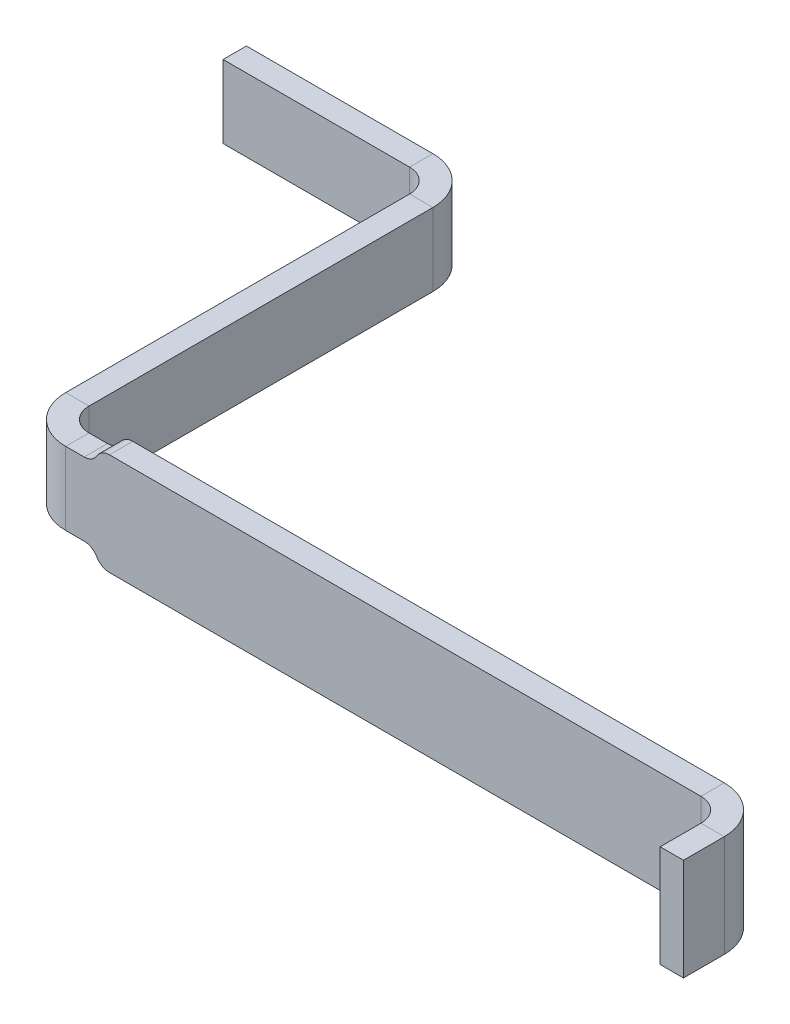
ISO-10303-21;
HEADER;
FILE_DESCRIPTION(('STEP AP214'),'2;1');
FILE_NAME('part.step','',(''),(''),'','','');
FILE_SCHEMA(('AUTOMOTIVE_DESIGN { 1 0 10303 214 1 1 1 1 }'));
ENDSEC;
DATA;
#1=APPLICATION_CONTEXT('core data for automotive mechanical design processes');
#2=APPLICATION_PROTOCOL_DEFINITION('international standard','automotive_design',2000,#1);
#3=PRODUCT_CONTEXT('',#1,'mechanical');
#4=PRODUCT('Part','Part','',(#3));
#5=PRODUCT_RELATED_PRODUCT_CATEGORY('part','',(#4));
#6=PRODUCT_DEFINITION_FORMATION('','',#4);
#7=PRODUCT_DEFINITION_CONTEXT('part definition',#1,'design');
#8=PRODUCT_DEFINITION('design','',#6,#7);
#9=PRODUCT_DEFINITION_SHAPE('','',#8);
#10=(LENGTH_UNIT() NAMED_UNIT(*) SI_UNIT(.MILLI.,.METRE.));
#11=(NAMED_UNIT(*) PLANE_ANGLE_UNIT() SI_UNIT($,.RADIAN.));
#12=(NAMED_UNIT(*) SI_UNIT($,.STERADIAN.) SOLID_ANGLE_UNIT());
#13=UNCERTAINTY_MEASURE_WITH_UNIT(LENGTH_MEASURE(1.E-05),#10,'distance_accuracy_value','');
#14=(GEOMETRIC_REPRESENTATION_CONTEXT(3) GLOBAL_UNCERTAINTY_ASSIGNED_CONTEXT((#13)) GLOBAL_UNIT_ASSIGNED_CONTEXT((#10,
#11,#12)) REPRESENTATION_CONTEXT('',''));
#15=CARTESIAN_POINT('',(0.,0.,0.));
#16=DIRECTION('',(0.,0.,1.));
#17=DIRECTION('',(1.,0.,0.));
#18=AXIS2_PLACEMENT_3D('',#15,#16,#17);
#19=CARTESIAN_POINT('',(0.05,0.,1.37));
#20=DIRECTION('',(0.,0.,-1.));
#21=DIRECTION('',(0.,-1.,0.));
#22=AXIS2_PLACEMENT_3D('',#19,#20,#21);
#23=PLANE('',#22);
#24=DIRECTION('',(-1.,0.,0.));
#25=VECTOR('',#24,1.);
#26=CARTESIAN_POINT('',(-0.463301270189222,0.125,1.37));
#27=LINE('',#26,#25);
#28=CARTESIAN_POINT('',(-0.976602540378444,0.125,1.37));
#29=VERTEX_POINT('',#28);
#30=CARTESIAN_POINT('',(-1.04,0.125,1.37));
#31=VERTEX_POINT('',#30);
#32=EDGE_CURVE('E300',#29,#31,#27,.T.);
#33=ORIENTED_EDGE('',*,*,#32,.T.);
#34=DIRECTION('',(0.,-1.,0.));
#35=VECTOR('',#34,1.);
#36=CARTESIAN_POINT('',(-1.04,-0.0875,1.37));
#37=LINE('',#36,#35);
#38=CARTESIAN_POINT('',(-1.04,-0.125,1.37));
#39=VERTEX_POINT('',#38);
#40=EDGE_CURVE('E417',#31,#39,#37,.T.);
#41=ORIENTED_EDGE('',*,*,#40,.T.);
#42=DIRECTION('',(1.,0.,0.));
#43=VECTOR('',#42,1.);
#44=CARTESIAN_POINT('',(-1.56836281798667,-0.125,1.37));
#45=LINE('',#44,#43);
#46=CARTESIAN_POINT('',(-0.976602540378444,-0.125,1.37));
#47=VERTEX_POINT('',#46);
#48=EDGE_CURVE('E274',#39,#47,#45,.T.);
#49=ORIENTED_EDGE('',*,*,#48,.T.);
#50=CARTESIAN_POINT('',(-0.976602540378444,-0.175,1.37));
#51=DIRECTION('',(0.,0.,-1.));
#52=DIRECTION('',(0.866025403784445,0.499999999999988,0.));
#53=AXIS2_PLACEMENT_3D('',#50,#51,#52);
#54=CIRCLE('',#53,0.05);
#55=CARTESIAN_POINT('',(-0.933301270189222,-0.15,1.37));
#56=VERTEX_POINT('',#55);
#57=EDGE_CURVE('E66',#47,#56,#54,.T.);
#58=ORIENTED_EDGE('',*,*,#57,.T.);
#59=CARTESIAN_POINT('',(-0.89,-0.125,1.37));
#60=DIRECTION('',(0.,0.,1.));
#61=DIRECTION('',(-0.86602540378444,-0.5,0.));
#62=AXIS2_PLACEMENT_3D('',#59,#60,#61);
#63=CIRCLE('',#62,0.05);
#64=CARTESIAN_POINT('',(-0.89,-0.175,1.37));
#65=VERTEX_POINT('',#64);
#66=EDGE_CURVE('E184',#56,#65,#63,.T.);
#67=ORIENTED_EDGE('',*,*,#66,.T.);
#68=DIRECTION('',(1.,0.,0.));
#69=VECTOR('',#68,1.);
#70=CARTESIAN_POINT('',(-1.2,-0.175,1.37));
#71=LINE('',#70,#69);
#72=CARTESIAN_POINT('',(1.14,-0.175,1.37));
#73=VERTEX_POINT('',#72);
#74=EDGE_CURVE('E11',#65,#73,#71,.T.);
#75=ORIENTED_EDGE('',*,*,#74,.T.);
#76=DIRECTION('',(0.,1.,0.));
#77=VECTOR('',#76,1.);
#78=CARTESIAN_POINT('',(1.14,-0.0875,1.37));
#79=LINE('',#78,#77);
#80=CARTESIAN_POINT('',(1.14,0.175,1.37));
#81=VERTEX_POINT('',#80);
#82=EDGE_CURVE('E28',#73,#81,#79,.T.);
#83=ORIENTED_EDGE('',*,*,#82,.T.);
#84=DIRECTION('',(-1.,0.,0.));
#85=VECTOR('',#84,1.);
#86=CARTESIAN_POINT('',(1.3,0.175,1.37));
#87=LINE('',#86,#85);
#88=CARTESIAN_POINT('',(-0.89,0.175,1.37));
#89=VERTEX_POINT('',#88);
#90=EDGE_CURVE('E233',#81,#89,#87,.T.);
#91=ORIENTED_EDGE('',*,*,#90,.T.);
#92=CARTESIAN_POINT('',(-0.89,0.125,1.37));
#93=DIRECTION('',(0.,0.,1.));
#94=DIRECTION('',(0.,1.,0.));
#95=AXIS2_PLACEMENT_3D('',#92,#93,#94);
#96=CIRCLE('',#95,0.05);
#97=CARTESIAN_POINT('',(-0.933301270189222,0.15,1.37));
#98=VERTEX_POINT('',#97);
#99=EDGE_CURVE('E281',#89,#98,#96,.T.);
#100=ORIENTED_EDGE('',*,*,#99,.T.);
#101=CARTESIAN_POINT('',(-0.976602540378444,0.175,1.37));
#102=DIRECTION('',(0.,0.,-1.));
#103=DIRECTION('',(0.,-1.,0.));
#104=AXIS2_PLACEMENT_3D('',#101,#102,#103);
#105=CIRCLE('',#104,0.05);
#106=EDGE_CURVE('E280',#98,#29,#105,.T.);
#107=ORIENTED_EDGE('',*,*,#106,.T.);
#108=EDGE_LOOP('',(#33,#41,#49,#58,#67,#75,#83,#91,#100,#107));
#109=FACE_BOUND('',#108,.T.);
#110=ADVANCED_FACE('F17',(#109),#23,.F.);
#111=CARTESIAN_POINT('',(1.3,-0.175,1.37));
#112=DIRECTION('',(0.,-1.,0.));
#113=DIRECTION('',(0.,0.,-1.));
#114=AXIS2_PLACEMENT_3D('',#111,#112,#113);
#115=PLANE('',#114);
#116=DIRECTION('',(0.,0.,1.));
#117=VECTOR('',#116,1.);
#118=CARTESIAN_POINT('',(-0.89,-0.175,1.37));
#119=LINE('',#118,#117);
#120=CARTESIAN_POINT('',(-0.89,-0.175,1.29));
#121=VERTEX_POINT('',#120);
#122=EDGE_CURVE('E194',#121,#65,#119,.T.);
#123=ORIENTED_EDGE('',*,*,#122,.F.);
#124=DIRECTION('',(-1.,0.,0.));
#125=VECTOR('',#124,1.);
#126=CARTESIAN_POINT('',(-1.2,-0.175,1.29));
#127=LINE('',#126,#125);
#128=CARTESIAN_POINT('',(1.14,-0.175,1.29));
#129=VERTEX_POINT('',#128);
#130=EDGE_CURVE('E191',#129,#121,#127,.T.);
#131=ORIENTED_EDGE('',*,*,#130,.F.);
#132=DIRECTION('',(0.,0.,1.));
#133=VECTOR('',#132,1.);
#134=CARTESIAN_POINT('',(1.14,-0.175,1.37));
#135=LINE('',#134,#133);
#136=EDGE_CURVE('E303',#129,#73,#135,.T.);
#137=ORIENTED_EDGE('',*,*,#136,.T.);
#138=ORIENTED_EDGE('',*,*,#74,.F.);
#139=EDGE_LOOP('',(#123,#131,#137,#138));
#140=FACE_BOUND('',#139,.T.);
#141=ADVANCED_FACE('F812',(#140),#115,.T.);
#142=CARTESIAN_POINT('',(1.3,0.,0.196637182013331));
#143=DIRECTION('',(1.,0.,0.));
#144=DIRECTION('',(0.,0.,1.));
#145=AXIS2_PLACEMENT_3D('',#142,#143,#144);
#146=PLANE('',#145);
#147=DIRECTION('',(0.,1.,0.));
#148=VECTOR('',#147,1.);
#149=CARTESIAN_POINT('',(1.3,0.,1.45));
#150=LINE('',#149,#148);
#151=CARTESIAN_POINT('',(1.3,-0.175,1.45));
#152=VERTEX_POINT('',#151);
#153=CARTESIAN_POINT('',(1.3,0.175,1.45));
#154=VERTEX_POINT('',#153);
#155=EDGE_CURVE('E332',#152,#154,#150,.T.);
#156=ORIENTED_EDGE('',*,*,#155,.T.);
#157=DIRECTION('',(0.,0.,1.));
#158=VECTOR('',#157,1.);
#159=CARTESIAN_POINT('',(1.3,0.175,1.12327436402666));
#160=LINE('',#159,#158);
#161=CARTESIAN_POINT('',(1.3,0.175,1.59));
#162=VERTEX_POINT('',#161);
#163=EDGE_CURVE('E289',#154,#162,#160,.T.);
#164=ORIENTED_EDGE('',*,*,#163,.T.);
#165=DIRECTION('',(0.,-1.,0.));
#166=VECTOR('',#165,1.);
#167=CARTESIAN_POINT('',(1.3,-0.175,1.59));
#168=LINE('',#167,#166);
#169=CARTESIAN_POINT('',(1.3,-0.175,1.59));
#170=VERTEX_POINT('',#169);
#171=EDGE_CURVE('E42',#162,#170,#168,.T.);
#172=ORIENTED_EDGE('',*,*,#171,.T.);
#173=DIRECTION('',(0.,0.,-1.));
#174=VECTOR('',#173,1.);
#175=CARTESIAN_POINT('',(1.3,-0.175,1.45));
#176=LINE('',#175,#174);
#177=EDGE_CURVE('E312',#170,#152,#176,.T.);
#178=ORIENTED_EDGE('',*,*,#177,.T.);
#179=EDGE_LOOP('',(#156,#164,#172,#178));
#180=FACE_BOUND('',#179,.T.);
#181=ADVANCED_FACE('F554',(#180),#146,.T.);
#182=CARTESIAN_POINT('',(1.14,0.,1.45));
#183=DIRECTION('',(0.,-1.,0.));
#184=DIRECTION('',(0.,0.,-1.));
#185=AXIS2_PLACEMENT_3D('',#182,#183,#184);
#186=CYLINDRICAL_SURFACE('',#185,0.08);
#187=DIRECTION('',(0.,-1.,0.));
#188=VECTOR('',#187,1.);
#189=CARTESIAN_POINT('',(1.22,0.,1.45));
#190=LINE('',#189,#188);
#191=CARTESIAN_POINT('',(1.22,0.175,1.45));
#192=VERTEX_POINT('',#191);
#193=CARTESIAN_POINT('',(1.22,-0.175,1.45));
#194=VERTEX_POINT('',#193);
#195=EDGE_CURVE('E231',#192,#194,#190,.T.);
#196=ORIENTED_EDGE('',*,*,#195,.F.);
#197=CARTESIAN_POINT('',(1.14,0.175,1.45));
#198=DIRECTION('',(0.,1.,0.));
#199=DIRECTION('',(1.,0.,0.));
#200=AXIS2_PLACEMENT_3D('',#197,#198,#199);
#201=CIRCLE('',#200,0.08);
#202=EDGE_CURVE('E307',#192,#81,#201,.T.);
#203=ORIENTED_EDGE('',*,*,#202,.T.);
#204=ORIENTED_EDGE('',*,*,#82,.F.);
#205=CARTESIAN_POINT('',(1.14,-0.175,1.45));
#206=DIRECTION('',(0.,1.,0.));
#207=DIRECTION('',(1.,0.,0.));
#208=AXIS2_PLACEMENT_3D('',#205,#206,#207);
#209=CIRCLE('',#208,0.08);
#210=EDGE_CURVE('E308',#194,#73,#209,.T.);
#211=ORIENTED_EDGE('',*,*,#210,.F.);
#212=EDGE_LOOP('',(#196,#203,#204,#211));
#213=FACE_BOUND('',#212,.T.);
#214=ADVANCED_FACE('F543',(#213),#186,.F.);
#215=CARTESIAN_POINT('',(1.22,0.175,1.59));
#216=DIRECTION('',(0.,0.,1.));
#217=DIRECTION('',(1.,0.,0.));
#218=AXIS2_PLACEMENT_3D('',#215,#216,#217);
#219=PLANE('',#218);
#220=DIRECTION('',(0.,1.,0.));
#221=VECTOR('',#220,1.);
#222=CARTESIAN_POINT('',(1.22,-0.175,1.59));
#223=LINE('',#222,#221);
#224=CARTESIAN_POINT('',(1.22,-0.175,1.59));
#225=VERTEX_POINT('',#224);
#226=CARTESIAN_POINT('',(1.22,0.175,1.59));
#227=VERTEX_POINT('',#226);
#228=EDGE_CURVE('E230',#225,#227,#223,.T.);
#229=ORIENTED_EDGE('',*,*,#228,.F.);
#230=DIRECTION('',(1.,0.,0.));
#231=VECTOR('',#230,1.);
#232=CARTESIAN_POINT('',(1.22,-0.175,1.59));
#233=LINE('',#232,#231);
#234=EDGE_CURVE('E21',#225,#170,#233,.T.);
#235=ORIENTED_EDGE('',*,*,#234,.T.);
#236=ORIENTED_EDGE('',*,*,#171,.F.);
#237=DIRECTION('',(1.,0.,0.));
#238=VECTOR('',#237,1.);
#239=CARTESIAN_POINT('',(1.22,0.175,1.59));
#240=LINE('',#239,#238);
#241=EDGE_CURVE('E285',#227,#162,#240,.T.);
#242=ORIENTED_EDGE('',*,*,#241,.F.);
#243=EDGE_LOOP('',(#229,#235,#236,#242));
#244=FACE_BOUND('',#243,.T.);
#245=ADVANCED_FACE('F840',(#244),#219,.T.);
#246=CARTESIAN_POINT('',(1.22,-0.175,1.59));
#247=DIRECTION('',(0.,-1.,0.));
#248=DIRECTION('',(0.,0.,-1.));
#249=AXIS2_PLACEMENT_3D('',#246,#247,#248);
#250=PLANE('',#249);
#251=DIRECTION('',(1.,0.,0.));
#252=VECTOR('',#251,1.);
#253=CARTESIAN_POINT('',(1.232,-0.175,1.45));
#254=LINE('',#253,#252);
#255=EDGE_CURVE('E351',#194,#152,#254,.T.);
#256=ORIENTED_EDGE('',*,*,#255,.T.);
#257=ORIENTED_EDGE('',*,*,#177,.F.);
#258=ORIENTED_EDGE('',*,*,#234,.F.);
#259=DIRECTION('',(0.,0.,-1.));
#260=VECTOR('',#259,1.);
#261=CARTESIAN_POINT('',(1.22,-0.175,1.12327436402666));
#262=LINE('',#261,#260);
#263=EDGE_CURVE('E227',#225,#194,#262,.T.);
#264=ORIENTED_EDGE('',*,*,#263,.T.);
#265=EDGE_LOOP('',(#256,#257,#258,#264));
#266=FACE_BOUND('',#265,.T.);
#267=ADVANCED_FACE('F897',(#266),#250,.T.);
#268=CARTESIAN_POINT('',(1.3,0.175,1.45));
#269=DIRECTION('',(0.,1.,0.));
#270=DIRECTION('',(1.,0.,0.));
#271=AXIS2_PLACEMENT_3D('',#268,#269,#270);
#272=PLANE('',#271);
#273=DIRECTION('',(-1.,0.,0.));
#274=VECTOR('',#273,1.);
#275=CARTESIAN_POINT('',(1.232,0.175,1.45));
#276=LINE('',#275,#274);
#277=EDGE_CURVE('E371',#154,#192,#276,.T.);
#278=ORIENTED_EDGE('',*,*,#277,.F.);
#279=CARTESIAN_POINT('',(1.14,0.175,1.45));
#280=DIRECTION('',(0.,-1.,0.));
#281=DIRECTION('',(0.,0.,-1.));
#282=AXIS2_PLACEMENT_3D('',#279,#280,#281);
#283=CIRCLE('',#282,0.16);
#284=CARTESIAN_POINT('',(1.14,0.175,1.29));
#285=VERTEX_POINT('',#284);
#286=EDGE_CURVE('E331',#285,#154,#283,.T.);
#287=ORIENTED_EDGE('',*,*,#286,.F.);
#288=DIRECTION('',(0.,0.,-1.));
#289=VECTOR('',#288,1.);
#290=CARTESIAN_POINT('',(1.14,0.175,1.37));
#291=LINE('',#290,#289);
#292=EDGE_CURVE('E216',#81,#285,#291,.T.);
#293=ORIENTED_EDGE('',*,*,#292,.F.);
#294=ORIENTED_EDGE('',*,*,#202,.F.);
#295=EDGE_LOOP('',(#278,#287,#293,#294));
#296=FACE_BOUND('',#295,.T.);
#297=ADVANCED_FACE('F539',(#296),#272,.T.);
#298=CARTESIAN_POINT('',(1.22,-0.175,1.45));
#299=DIRECTION('',(0.,-1.,0.));
#300=DIRECTION('',(0.,0.,-1.));
#301=AXIS2_PLACEMENT_3D('',#298,#299,#300);
#302=PLANE('',#301);
#303=ORIENTED_EDGE('',*,*,#255,.F.);
#304=ORIENTED_EDGE('',*,*,#210,.T.);
#305=ORIENTED_EDGE('',*,*,#136,.F.);
#306=CARTESIAN_POINT('',(1.14,-0.175,1.45));
#307=DIRECTION('',(0.,1.,0.));
#308=DIRECTION('',(1.,0.,0.));
#309=AXIS2_PLACEMENT_3D('',#306,#307,#308);
#310=CIRCLE('',#309,0.16);
#311=EDGE_CURVE('E327',#152,#129,#310,.T.);
#312=ORIENTED_EDGE('',*,*,#311,.F.);
#313=EDGE_LOOP('',(#303,#304,#305,#312));
#314=FACE_BOUND('',#313,.T.);
#315=ADVANCED_FACE('F925',(#314),#302,.T.);
#316=CARTESIAN_POINT('',(1.22,0.,0.196637182013331));
#317=DIRECTION('',(1.,0.,0.));
#318=DIRECTION('',(0.,0.,1.));
#319=AXIS2_PLACEMENT_3D('',#316,#317,#318);
#320=PLANE('',#319);
#321=ORIENTED_EDGE('',*,*,#195,.T.);
#322=ORIENTED_EDGE('',*,*,#263,.F.);
#323=ORIENTED_EDGE('',*,*,#228,.T.);
#324=DIRECTION('',(0.,0.,-1.));
#325=VECTOR('',#324,1.);
#326=CARTESIAN_POINT('',(1.22,0.175,1.12327436402666));
#327=LINE('',#326,#325);
#328=EDGE_CURVE('E290',#227,#192,#327,.T.);
#329=ORIENTED_EDGE('',*,*,#328,.T.);
#330=EDGE_LOOP('',(#321,#322,#323,#329));
#331=FACE_BOUND('',#330,.T.);
#332=ADVANCED_FACE('F548',(#331),#320,.F.);
#333=CARTESIAN_POINT('',(1.22,0.175,1.28663718201333));
#334=DIRECTION('',(0.,1.,0.));
#335=DIRECTION('',(1.,0.,0.));
#336=AXIS2_PLACEMENT_3D('',#333,#334,#335);
#337=PLANE('',#336);
#338=ORIENTED_EDGE('',*,*,#277,.T.);
#339=ORIENTED_EDGE('',*,*,#328,.F.);
#340=ORIENTED_EDGE('',*,*,#241,.T.);
#341=ORIENTED_EDGE('',*,*,#163,.F.);
#342=EDGE_LOOP('',(#338,#339,#340,#341));
#343=FACE_BOUND('',#342,.T.);
#344=ADVANCED_FACE('F552',(#343),#337,.T.);
#345=CARTESIAN_POINT('',(1.14,0.,1.45));
#346=DIRECTION('',(0.,-1.,0.));
#347=DIRECTION('',(0.,0.,-1.));
#348=AXIS2_PLACEMENT_3D('',#345,#346,#347);
#349=CYLINDRICAL_SURFACE('',#348,0.16);
#350=ORIENTED_EDGE('',*,*,#155,.F.);
#351=ORIENTED_EDGE('',*,*,#311,.T.);
#352=DIRECTION('',(0.,-1.,0.));
#353=VECTOR('',#352,1.);
#354=CARTESIAN_POINT('',(1.14,-0.0875,1.29));
#355=LINE('',#354,#353);
#356=EDGE_CURVE('E217',#285,#129,#355,.T.);
#357=ORIENTED_EDGE('',*,*,#356,.F.);
#358=ORIENTED_EDGE('',*,*,#286,.T.);
#359=EDGE_LOOP('',(#350,#351,#357,#358));
#360=FACE_BOUND('',#359,.T.);
#361=ADVANCED_FACE('F829',(#360),#349,.T.);
#362=CARTESIAN_POINT('',(-1.2,0.,2.46336281798667));
#363=DIRECTION('',(1.,0.,0.));
#364=DIRECTION('',(0.,0.,1.));
#365=AXIS2_PLACEMENT_3D('',#362,#363,#364);
#366=PLANE('',#365);
#367=DIRECTION('',(0.,0.,-1.));
#368=VECTOR('',#367,1.);
#369=CARTESIAN_POINT('',(-1.2,0.125,1.95006154779745));
#370=LINE('',#369,#368);
#371=CARTESIAN_POINT('',(-1.2,0.125,1.21));
#372=VERTEX_POINT('',#371);
#373=CARTESIAN_POINT('',(-1.2,0.125,0.0299999999999995));
#374=VERTEX_POINT('',#373);
#375=EDGE_CURVE('E273',#372,#374,#370,.T.);
#376=ORIENTED_EDGE('',*,*,#375,.T.);
#377=DIRECTION('',(0.,-1.,0.));
#378=VECTOR('',#377,1.);
#379=CARTESIAN_POINT('',(-1.2,0.0875,0.0299999999999995));
#380=LINE('',#379,#378);
#381=CARTESIAN_POINT('',(-1.2,-0.125,0.0299999999999995));
#382=VERTEX_POINT('',#381);
#383=EDGE_CURVE('E252',#374,#382,#380,.T.);
#384=ORIENTED_EDGE('',*,*,#383,.T.);
#385=DIRECTION('',(0.,0.,1.));
#386=VECTOR('',#385,1.);
#387=CARTESIAN_POINT('',(-1.2,-0.125,0.845));
#388=LINE('',#387,#386);
#389=CARTESIAN_POINT('',(-1.2,-0.125,1.21));
#390=VERTEX_POINT('',#389);
#391=EDGE_CURVE('E269',#382,#390,#388,.T.);
#392=ORIENTED_EDGE('',*,*,#391,.T.);
#393=DIRECTION('',(0.,1.,0.));
#394=VECTOR('',#393,1.);
#395=CARTESIAN_POINT('',(-1.2,0.,1.21));
#396=LINE('',#395,#394);
#397=EDGE_CURVE('E262',#390,#372,#396,.T.);
#398=ORIENTED_EDGE('',*,*,#397,.T.);
#399=EDGE_LOOP('',(#376,#384,#392,#398));
#400=FACE_BOUND('',#399,.T.);
#401=ADVANCED_FACE('F823',(#400),#366,.F.);
#402=CARTESIAN_POINT('',(-1.04,0.,1.21));
#403=DIRECTION('',(0.,-1.,0.));
#404=DIRECTION('',(0.,0.,1.));
#405=AXIS2_PLACEMENT_3D('',#402,#403,#404);
#406=CYLINDRICAL_SURFACE('',#405,0.16);
#407=CARTESIAN_POINT('',(-1.04,0.125,1.21));
#408=DIRECTION('',(0.,-1.,0.));
#409=DIRECTION('',(0.,0.,1.));
#410=AXIS2_PLACEMENT_3D('',#407,#408,#409);
#411=CIRCLE('',#410,0.16);
#412=EDGE_CURVE('E408',#31,#372,#411,.T.);
#413=ORIENTED_EDGE('',*,*,#412,.T.);
#414=ORIENTED_EDGE('',*,*,#397,.F.);
#415=CARTESIAN_POINT('',(-1.04,-0.125,1.21));
#416=DIRECTION('',(0.,1.,0.));
#417=DIRECTION('',(-1.,0.,0.));
#418=AXIS2_PLACEMENT_3D('',#415,#416,#417);
#419=CIRCLE('',#418,0.16);
#420=EDGE_CURVE('E225',#390,#39,#419,.T.);
#421=ORIENTED_EDGE('',*,*,#420,.T.);
#422=ORIENTED_EDGE('',*,*,#40,.F.);
#423=EDGE_LOOP('',(#413,#414,#421,#422));
#424=FACE_BOUND('',#423,.T.);
#425=ADVANCED_FACE('F828',(#424),#406,.T.);
#426=CARTESIAN_POINT('',(1.31672563597334,0.,-0.129999999999998));
#427=DIRECTION('',(0.,0.,-1.));
#428=DIRECTION('',(0.,-1.,0.));
#429=AXIS2_PLACEMENT_3D('',#426,#427,#428);
#430=PLANE('',#429);
#431=DIRECTION('',(1.,0.,0.));
#432=VECTOR('',#431,1.);
#433=CARTESIAN_POINT('',(0.803424365784118,0.125,-0.13));
#434=LINE('',#433,#432);
#435=CARTESIAN_POINT('',(-1.92,0.125,-0.13));
#436=VERTEX_POINT('',#435);
#437=CARTESIAN_POINT('',(-1.28,0.125,-0.13));
#438=VERTEX_POINT('',#437);
#439=EDGE_CURVE('E378',#436,#438,#434,.T.);
#440=ORIENTED_EDGE('',*,*,#439,.T.);
#441=DIRECTION('',(0.,-1.,0.));
#442=VECTOR('',#441,1.);
#443=CARTESIAN_POINT('',(-1.28,0.,-0.13));
#444=LINE('',#443,#442);
#445=CARTESIAN_POINT('',(-1.28,-0.125,-0.13));
#446=VERTEX_POINT('',#445);
#447=EDGE_CURVE('E263',#438,#446,#444,.T.);
#448=ORIENTED_EDGE('',*,*,#447,.T.);
#449=DIRECTION('',(-1.,0.,0.));
#450=VECTOR('',#449,1.);
#451=CARTESIAN_POINT('',(-0.30163718201333,-0.125,-0.13));
#452=LINE('',#451,#450);
#453=CARTESIAN_POINT('',(-1.92,-0.125,-0.13));
#454=VERTEX_POINT('',#453);
#455=EDGE_CURVE('E195',#446,#454,#452,.T.);
#456=ORIENTED_EDGE('',*,*,#455,.T.);
#457=DIRECTION('',(0.,1.,0.));
#458=VECTOR('',#457,1.);
#459=CARTESIAN_POINT('',(-1.92,0.175,-0.13));
#460=LINE('',#459,#458);
#461=EDGE_CURVE('E258',#454,#436,#460,.T.);
#462=ORIENTED_EDGE('',*,*,#461,.T.);
#463=EDGE_LOOP('',(#440,#448,#456,#462));
#464=FACE_BOUND('',#463,.T.);
#465=ADVANCED_FACE('F798',(#464),#430,.T.);
#466=CARTESIAN_POINT('',(-1.92,-0.175,-0.0500000000000009));
#467=DIRECTION('',(-1.,0.,0.));
#468=DIRECTION('',(0.,0.,1.));
#469=AXIS2_PLACEMENT_3D('',#466,#467,#468);
#470=PLANE('',#469);
#471=DIRECTION('',(0.,0.,-1.));
#472=VECTOR('',#471,1.);
#473=CARTESIAN_POINT('',(-1.92,0.125,-0.0500000000000009));
#474=LINE('',#473,#472);
#475=CARTESIAN_POINT('',(-1.92,0.125,-0.0500000000000053));
#476=VERTEX_POINT('',#475);
#477=EDGE_CURVE('E382',#476,#436,#474,.T.);
#478=ORIENTED_EDGE('',*,*,#477,.T.);
#479=ORIENTED_EDGE('',*,*,#461,.F.);
#480=DIRECTION('',(0.,0.,1.));
#481=VECTOR('',#480,1.);
#482=CARTESIAN_POINT('',(-1.92,-0.125,-0.0500000000000031));
#483=LINE('',#482,#481);
#484=CARTESIAN_POINT('',(-1.92,-0.125,-0.0500000000000053));
#485=VERTEX_POINT('',#484);
#486=EDGE_CURVE('E204',#454,#485,#483,.T.);
#487=ORIENTED_EDGE('',*,*,#486,.T.);
#488=DIRECTION('',(0.,-1.,0.));
#489=VECTOR('',#488,1.);
#490=CARTESIAN_POINT('',(-1.92,0.175,-0.0500000000000009));
#491=LINE('',#490,#489);
#492=EDGE_CURVE('E220',#476,#485,#491,.T.);
#493=ORIENTED_EDGE('',*,*,#492,.F.);
#494=EDGE_LOOP('',(#478,#479,#487,#493));
#495=FACE_BOUND('',#494,.T.);
#496=ADVANCED_FACE('F792',(#495),#470,.T.);
#497=CARTESIAN_POINT('',(-1.28,0.,0.0299999999999992));
#498=DIRECTION('',(0.,1.,0.));
#499=DIRECTION('',(1.,0.,0.));
#500=AXIS2_PLACEMENT_3D('',#497,#498,#499);
#501=CYLINDRICAL_SURFACE('',#500,0.159999999999997);
#502=CARTESIAN_POINT('',(-1.28,0.125,0.0299999999999992));
#503=DIRECTION('',(0.,-1.,0.));
#504=DIRECTION('',(0.,0.,-1.));
#505=AXIS2_PLACEMENT_3D('',#502,#503,#504);
#506=CIRCLE('',#505,0.160000000000003);
#507=CARTESIAN_POINT('',(-1.12,0.125,0.0299999999999995));
#508=VERTEX_POINT('',#507);
#509=EDGE_CURVE('E363',#438,#508,#506,.T.);
#510=ORIENTED_EDGE('',*,*,#509,.T.);
#511=DIRECTION('',(0.,1.,0.));
#512=VECTOR('',#511,1.);
#513=CARTESIAN_POINT('',(-1.12,0.0875,0.0299999999999995));
#514=LINE('',#513,#512);
#515=CARTESIAN_POINT('',(-1.12,-0.125,0.0299999999999995));
#516=VERTEX_POINT('',#515);
#517=EDGE_CURVE('E236',#516,#508,#514,.T.);
#518=ORIENTED_EDGE('',*,*,#517,.F.);
#519=CARTESIAN_POINT('',(-1.28,-0.125,0.0299999999999992));
#520=DIRECTION('',(0.,1.,0.));
#521=DIRECTION('',(1.,0.,0.));
#522=AXIS2_PLACEMENT_3D('',#519,#520,#521);
#523=CIRCLE('',#522,0.160000000000003);
#524=EDGE_CURVE('E376',#516,#446,#523,.T.);
#525=ORIENTED_EDGE('',*,*,#524,.T.);
#526=ORIENTED_EDGE('',*,*,#447,.F.);
#527=EDGE_LOOP('',(#510,#518,#525,#526));
#528=FACE_BOUND('',#527,.T.);
#529=ADVANCED_FACE('F797',(#528),#501,.T.);
#530=CARTESIAN_POINT('',(0.05,0.,1.29));
#531=DIRECTION('',(0.,0.,-1.));
#532=DIRECTION('',(0.,-1.,0.));
#533=AXIS2_PLACEMENT_3D('',#530,#531,#532);
#534=PLANE('',#533);
#535=DIRECTION('',(1.,0.,0.));
#536=VECTOR('',#535,1.);
#537=CARTESIAN_POINT('',(-0.463301270189222,0.125,1.29));
#538=LINE('',#537,#536);
#539=CARTESIAN_POINT('',(-1.04,0.125,1.29));
#540=VERTEX_POINT('',#539);
#541=CARTESIAN_POINT('',(-0.976602540378444,0.125,1.29));
#542=VERTEX_POINT('',#541);
#543=EDGE_CURVE('E448',#540,#542,#538,.T.);
#544=ORIENTED_EDGE('',*,*,#543,.T.);
#545=CARTESIAN_POINT('',(-0.976602540378444,0.175,1.29));
#546=DIRECTION('',(0.,0.,1.));
#547=DIRECTION('',(0.,-1.,0.));
#548=AXIS2_PLACEMENT_3D('',#545,#546,#547);
#549=CIRCLE('',#548,0.05);
#550=CARTESIAN_POINT('',(-0.933301270189222,0.15,1.29));
#551=VERTEX_POINT('',#550);
#552=EDGE_CURVE('E256',#542,#551,#549,.T.);
#553=ORIENTED_EDGE('',*,*,#552,.T.);
#554=CARTESIAN_POINT('',(-0.89,0.125,1.29));
#555=DIRECTION('',(0.,0.,-1.));
#556=DIRECTION('',(0.,1.,0.));
#557=AXIS2_PLACEMENT_3D('',#554,#555,#556);
#558=CIRCLE('',#557,0.05);
#559=CARTESIAN_POINT('',(-0.89,0.175,1.29));
#560=VERTEX_POINT('',#559);
#561=EDGE_CURVE('E279',#551,#560,#558,.T.);
#562=ORIENTED_EDGE('',*,*,#561,.T.);
#563=DIRECTION('',(1.,0.,0.));
#564=VECTOR('',#563,1.);
#565=CARTESIAN_POINT('',(1.3,0.175,1.29));
#566=LINE('',#565,#564);
#567=EDGE_CURVE('E211',#560,#285,#566,.T.);
#568=ORIENTED_EDGE('',*,*,#567,.T.);
#569=ORIENTED_EDGE('',*,*,#356,.T.);
#570=ORIENTED_EDGE('',*,*,#130,.T.);
#571=CARTESIAN_POINT('',(-0.89,-0.125,1.29));
#572=DIRECTION('',(0.,0.,-1.));
#573=DIRECTION('',(-0.86602540378444,-0.5,0.));
#574=AXIS2_PLACEMENT_3D('',#571,#572,#573);
#575=CIRCLE('',#574,0.05);
#576=CARTESIAN_POINT('',(-0.933301270189222,-0.15,1.29));
#577=VERTEX_POINT('',#576);
#578=EDGE_CURVE('E182',#121,#577,#575,.T.);
#579=ORIENTED_EDGE('',*,*,#578,.T.);
#580=CARTESIAN_POINT('',(-0.976602540378444,-0.175,1.29));
#581=DIRECTION('',(0.,0.,1.));
#582=DIRECTION('',(0.866025403784445,0.499999999999988,0.));
#583=AXIS2_PLACEMENT_3D('',#580,#581,#582);
#584=CIRCLE('',#583,0.05);
#585=CARTESIAN_POINT('',(-0.976602540378444,-0.125,1.29));
#586=VERTEX_POINT('',#585);
#587=EDGE_CURVE('E83',#577,#586,#584,.T.);
#588=ORIENTED_EDGE('',*,*,#587,.T.);
#589=DIRECTION('',(-1.,0.,0.));
#590=VECTOR('',#589,1.);
#591=CARTESIAN_POINT('',(-1.56836281798667,-0.125,1.29));
#592=LINE('',#591,#590);
#593=CARTESIAN_POINT('',(-1.04,-0.125,1.29));
#594=VERTEX_POINT('',#593);
#595=EDGE_CURVE('E317',#586,#594,#592,.T.);
#596=ORIENTED_EDGE('',*,*,#595,.T.);
#597=DIRECTION('',(0.,1.,0.));
#598=VECTOR('',#597,1.);
#599=CARTESIAN_POINT('',(-1.04,-0.0875,1.29));
#600=LINE('',#599,#598);
#601=EDGE_CURVE('E338',#594,#540,#600,.T.);
#602=ORIENTED_EDGE('',*,*,#601,.T.);
#603=EDGE_LOOP('',(#544,#553,#562,#568,#569,#570,#579,#588,#596,#602));
#604=FACE_BOUND('',#603,.T.);
#605=ADVANCED_FACE('F188',(#604),#534,.T.);
#606=CARTESIAN_POINT('',(1.31672563597334,0.,-0.0499999999999978));
#607=DIRECTION('',(0.,0.,-1.));
#608=DIRECTION('',(0.,-1.,0.));
#609=AXIS2_PLACEMENT_3D('',#606,#607,#608);
#610=PLANE('',#609);
#611=DIRECTION('',(-1.,0.,0.));
#612=VECTOR('',#611,1.);
#613=CARTESIAN_POINT('',(0.803424365784117,0.125,-0.0499999999999989));
#614=LINE('',#613,#612);
#615=CARTESIAN_POINT('',(-1.28,0.125,-0.0500000000000009));
#616=VERTEX_POINT('',#615);
#617=EDGE_CURVE('E377',#616,#476,#614,.T.);
#618=ORIENTED_EDGE('',*,*,#617,.T.);
#619=ORIENTED_EDGE('',*,*,#492,.T.);
#620=DIRECTION('',(1.,0.,0.));
#621=VECTOR('',#620,1.);
#622=CARTESIAN_POINT('',(-0.30163718201333,-0.125,-0.0500000000000014));
#623=LINE('',#622,#621);
#624=CARTESIAN_POINT('',(-1.28,-0.125,-0.0500000000000009));
#625=VERTEX_POINT('',#624);
#626=EDGE_CURVE('E208',#485,#625,#623,.T.);
#627=ORIENTED_EDGE('',*,*,#626,.T.);
#628=DIRECTION('',(0.,1.,0.));
#629=VECTOR('',#628,1.);
#630=CARTESIAN_POINT('',(-1.28,0.,-0.0500000000000009));
#631=LINE('',#630,#629);
#632=EDGE_CURVE('E245',#625,#616,#631,.T.);
#633=ORIENTED_EDGE('',*,*,#632,.T.);
#634=EDGE_LOOP('',(#618,#619,#627,#633));
#635=FACE_BOUND('',#634,.T.);
#636=ADVANCED_FACE('F845',(#635),#610,.F.);
#637=CARTESIAN_POINT('',(-1.04,0.,1.21));
#638=DIRECTION('',(0.,-1.,0.));
#639=DIRECTION('',(0.,0.,1.));
#640=AXIS2_PLACEMENT_3D('',#637,#638,#639);
#641=CYLINDRICAL_SURFACE('',#640,0.08);
#642=CARTESIAN_POINT('',(-1.04,0.125,1.21));
#643=DIRECTION('',(0.,1.,0.));
#644=DIRECTION('',(-1.,0.,0.));
#645=AXIS2_PLACEMENT_3D('',#642,#643,#644);
#646=CIRCLE('',#645,0.08);
#647=CARTESIAN_POINT('',(-1.12,0.125,1.21));
#648=VERTEX_POINT('',#647);
#649=EDGE_CURVE('E355',#648,#540,#646,.T.);
#650=ORIENTED_EDGE('',*,*,#649,.T.);
#651=ORIENTED_EDGE('',*,*,#601,.F.);
#652=CARTESIAN_POINT('',(-1.04,-0.125,1.21));
#653=DIRECTION('',(0.,-1.,0.));
#654=DIRECTION('',(0.,0.,1.));
#655=AXIS2_PLACEMENT_3D('',#652,#653,#654);
#656=CIRCLE('',#655,0.08);
#657=CARTESIAN_POINT('',(-1.12,-0.125,1.21));
#658=VERTEX_POINT('',#657);
#659=EDGE_CURVE('E226',#594,#658,#656,.T.);
#660=ORIENTED_EDGE('',*,*,#659,.T.);
#661=DIRECTION('',(0.,-1.,0.));
#662=VECTOR('',#661,1.);
#663=CARTESIAN_POINT('',(-1.12,0.,1.21));
#664=LINE('',#663,#662);
#665=EDGE_CURVE('E215',#648,#658,#664,.T.);
#666=ORIENTED_EDGE('',*,*,#665,.F.);
#667=EDGE_LOOP('',(#650,#651,#660,#666));
#668=FACE_BOUND('',#667,.T.);
#669=ADVANCED_FACE('F487',(#668),#641,.F.);
#670=CARTESIAN_POINT('',(-1.28,0.,0.0299999999999992));
#671=DIRECTION('',(0.,1.,0.));
#672=DIRECTION('',(1.,0.,0.));
#673=AXIS2_PLACEMENT_3D('',#670,#671,#672);
#674=CYLINDRICAL_SURFACE('',#673,0.0799999999999972);
#675=CARTESIAN_POINT('',(-1.28,0.125,0.0299999999999992));
#676=DIRECTION('',(0.,1.,0.));
#677=DIRECTION('',(1.,0.,0.));
#678=AXIS2_PLACEMENT_3D('',#675,#676,#677);
#679=CIRCLE('',#678,0.0800000000000026);
#680=EDGE_CURVE('E391',#374,#616,#679,.T.);
#681=ORIENTED_EDGE('',*,*,#680,.T.);
#682=ORIENTED_EDGE('',*,*,#632,.F.);
#683=CARTESIAN_POINT('',(-1.28,-0.125,0.0299999999999992));
#684=DIRECTION('',(0.,-1.,0.));
#685=DIRECTION('',(0.,0.,-1.));
#686=AXIS2_PLACEMENT_3D('',#683,#684,#685);
#687=CIRCLE('',#686,0.0800000000000028);
#688=EDGE_CURVE('E387',#625,#382,#687,.T.);
#689=ORIENTED_EDGE('',*,*,#688,.T.);
#690=ORIENTED_EDGE('',*,*,#383,.F.);
#691=EDGE_LOOP('',(#681,#682,#689,#690));
#692=FACE_BOUND('',#691,.T.);
#693=ADVANCED_FACE('F770',(#692),#674,.F.);
#694=CARTESIAN_POINT('',(-1.12,0.,2.46336281798667));
#695=DIRECTION('',(1.,0.,0.));
#696=DIRECTION('',(0.,0.,1.));
#697=AXIS2_PLACEMENT_3D('',#694,#695,#696);
#698=PLANE('',#697);
#699=DIRECTION('',(0.,0.,1.));
#700=VECTOR('',#699,1.);
#701=CARTESIAN_POINT('',(-1.12,0.125,1.95006154779745));
#702=LINE('',#701,#700);
#703=EDGE_CURVE('E270',#508,#648,#702,.T.);
#704=ORIENTED_EDGE('',*,*,#703,.T.);
#705=ORIENTED_EDGE('',*,*,#665,.T.);
#706=DIRECTION('',(0.,0.,-1.));
#707=VECTOR('',#706,1.);
#708=CARTESIAN_POINT('',(-1.12,-0.125,0.845));
#709=LINE('',#708,#707);
#710=EDGE_CURVE('E268',#658,#516,#709,.T.);
#711=ORIENTED_EDGE('',*,*,#710,.T.);
#712=ORIENTED_EDGE('',*,*,#517,.T.);
#713=EDGE_LOOP('',(#704,#705,#711,#712));
#714=FACE_BOUND('',#713,.T.);
#715=ADVANCED_FACE('F775',(#714),#698,.T.);
#716=CARTESIAN_POINT('',(-1.2,0.175,1.37));
#717=DIRECTION('',(0.,1.,0.));
#718=DIRECTION('',(1.,0.,0.));
#719=AXIS2_PLACEMENT_3D('',#716,#717,#718);
#720=PLANE('',#719);
#721=DIRECTION('',(0.,0.,1.));
#722=VECTOR('',#721,1.);
#723=CARTESIAN_POINT('',(-0.89,0.175,1.37));
#724=LINE('',#723,#722);
#725=EDGE_CURVE('E284',#560,#89,#724,.T.);
#726=ORIENTED_EDGE('',*,*,#725,.T.);
#727=ORIENTED_EDGE('',*,*,#90,.F.);
#728=ORIENTED_EDGE('',*,*,#292,.T.);
#729=ORIENTED_EDGE('',*,*,#567,.F.);
#730=EDGE_LOOP('',(#726,#727,#728,#729));
#731=FACE_BOUND('',#730,.T.);
#732=ADVANCED_FACE('F868',(#731),#720,.T.);
#733=CARTESIAN_POINT('',(-0.976602540378444,-0.175,1.37));
#734=DIRECTION('',(0.,0.,-1.));
#735=DIRECTION('',(0.866025403784446,0.499999999999988,0.));
#736=AXIS2_PLACEMENT_3D('',#733,#734,#735);
#737=CYLINDRICAL_SURFACE('',#736,0.05);
#738=ORIENTED_EDGE('',*,*,#587,.F.);
#739=DIRECTION('',(0.,0.,-1.));
#740=VECTOR('',#739,1.);
#741=CARTESIAN_POINT('',(-0.933301270189222,-0.15,1.37));
#742=LINE('',#741,#740);
#743=EDGE_CURVE('E171',#56,#577,#742,.T.);
#744=ORIENTED_EDGE('',*,*,#743,.F.);
#745=ORIENTED_EDGE('',*,*,#57,.F.);
#746=DIRECTION('',(0.,0.,-1.));
#747=VECTOR('',#746,1.);
#748=CARTESIAN_POINT('',(-0.976602540378444,-0.125,1.37));
#749=LINE('',#748,#747);
#750=EDGE_CURVE('E174',#47,#586,#749,.T.);
#751=ORIENTED_EDGE('',*,*,#750,.T.);
#752=EDGE_LOOP('',(#738,#744,#745,#751));
#753=FACE_BOUND('',#752,.T.);
#754=ADVANCED_FACE('F170',(#753),#737,.F.);
#755=CARTESIAN_POINT('',(-0.89,-0.125,1.37));
#756=DIRECTION('',(0.,0.,-1.));
#757=DIRECTION('',(-0.86602540378444,-0.5,0.));
#758=AXIS2_PLACEMENT_3D('',#755,#756,#757);
#759=CYLINDRICAL_SURFACE('',#758,0.05);
#760=ORIENTED_EDGE('',*,*,#578,.F.);
#761=ORIENTED_EDGE('',*,*,#122,.T.);
#762=ORIENTED_EDGE('',*,*,#66,.F.);
#763=ORIENTED_EDGE('',*,*,#743,.T.);
#764=EDGE_LOOP('',(#760,#761,#762,#763));
#765=FACE_BOUND('',#764,.T.);
#766=ADVANCED_FACE('F180',(#765),#759,.T.);
#767=CARTESIAN_POINT('',(-1.92,-0.125,-0.0500000000000053));
#768=DIRECTION('',(0.,1.,0.));
#769=DIRECTION('',(1.,0.,0.));
#770=AXIS2_PLACEMENT_3D('',#767,#768,#769);
#771=PLANE('',#770);
#772=DIRECTION('',(0.,0.,1.));
#773=VECTOR('',#772,1.);
#774=CARTESIAN_POINT('',(-1.28,-0.125,-0.0500000000000031));
#775=LINE('',#774,#773);
#776=EDGE_CURVE('E372',#446,#625,#775,.T.);
#777=ORIENTED_EDGE('',*,*,#776,.T.);
#778=ORIENTED_EDGE('',*,*,#626,.F.);
#779=ORIENTED_EDGE('',*,*,#486,.F.);
#780=ORIENTED_EDGE('',*,*,#455,.F.);
#781=EDGE_LOOP('',(#777,#778,#779,#780));
#782=FACE_BOUND('',#781,.T.);
#783=ADVANCED_FACE('F764',(#782),#771,.F.);
#784=CARTESIAN_POINT('',(-0.89,0.125,1.37));
#785=DIRECTION('',(0.,0.,-1.));
#786=DIRECTION('',(0.,1.,0.));
#787=AXIS2_PLACEMENT_3D('',#784,#785,#786);
#788=CYLINDRICAL_SURFACE('',#787,0.05);
#789=ORIENTED_EDGE('',*,*,#561,.F.);
#790=DIRECTION('',(0.,0.,-1.));
#791=VECTOR('',#790,1.);
#792=CARTESIAN_POINT('',(-0.933301270189222,0.15,1.37));
#793=LINE('',#792,#791);
#794=EDGE_CURVE('E275',#98,#551,#793,.T.);
#795=ORIENTED_EDGE('',*,*,#794,.F.);
#796=ORIENTED_EDGE('',*,*,#99,.F.);
#797=ORIENTED_EDGE('',*,*,#725,.F.);
#798=EDGE_LOOP('',(#789,#795,#796,#797));
#799=FACE_BOUND('',#798,.T.);
#800=ADVANCED_FACE('F755',(#799),#788,.T.);
#801=CARTESIAN_POINT('',(-0.976602540378444,0.175,1.37));
#802=DIRECTION('',(0.,0.,-1.));
#803=DIRECTION('',(0.,-1.,0.));
#804=AXIS2_PLACEMENT_3D('',#801,#802,#803);
#805=CYLINDRICAL_SURFACE('',#804,0.05);
#806=ORIENTED_EDGE('',*,*,#552,.F.);
#807=DIRECTION('',(0.,0.,-1.));
#808=VECTOR('',#807,1.);
#809=CARTESIAN_POINT('',(-0.976602540378444,0.125,1.37));
#810=LINE('',#809,#808);
#811=EDGE_CURVE('E345',#29,#542,#810,.T.);
#812=ORIENTED_EDGE('',*,*,#811,.F.);
#813=ORIENTED_EDGE('',*,*,#106,.F.);
#814=ORIENTED_EDGE('',*,*,#794,.T.);
#815=EDGE_LOOP('',(#806,#812,#813,#814));
#816=FACE_BOUND('',#815,.T.);
#817=ADVANCED_FACE('F480',(#816),#805,.F.);
#818=CARTESIAN_POINT('',(-1.2,0.125,1.43676027760822));
#819=DIRECTION('',(0.,-1.,0.));
#820=DIRECTION('',(0.,0.,-1.));
#821=AXIS2_PLACEMENT_3D('',#818,#819,#820);
#822=PLANE('',#821);
#823=DIRECTION('',(1.,0.,0.));
#824=VECTOR('',#823,1.);
#825=CARTESIAN_POINT('',(-1.2,0.125,1.21));
#826=LINE('',#825,#824);
#827=EDGE_CURVE('E393',#372,#648,#826,.T.);
#828=ORIENTED_EDGE('',*,*,#827,.T.);
#829=ORIENTED_EDGE('',*,*,#703,.F.);
#830=DIRECTION('',(1.,0.,0.));
#831=VECTOR('',#830,1.);
#832=CARTESIAN_POINT('',(-1.2,0.125,0.0299999999999995));
#833=LINE('',#832,#831);
#834=EDGE_CURVE('E367',#374,#508,#833,.T.);
#835=ORIENTED_EDGE('',*,*,#834,.F.);
#836=ORIENTED_EDGE('',*,*,#375,.F.);
#837=EDGE_LOOP('',(#828,#829,#835,#836));
#838=FACE_BOUND('',#837,.T.);
#839=ADVANCED_FACE('F744',(#838),#822,.F.);
#840=CARTESIAN_POINT('',(-3.18672563597334,-0.125,1.37));
#841=DIRECTION('',(0.,1.,0.));
#842=DIRECTION('',(1.,0.,0.));
#843=AXIS2_PLACEMENT_3D('',#840,#841,#842);
#844=PLANE('',#843);
#845=DIRECTION('',(0.,0.,1.));
#846=VECTOR('',#845,1.);
#847=CARTESIAN_POINT('',(-1.04,-0.125,1.37));
#848=LINE('',#847,#846);
#849=EDGE_CURVE('E221',#594,#39,#848,.T.);
#850=ORIENTED_EDGE('',*,*,#849,.F.);
#851=ORIENTED_EDGE('',*,*,#595,.F.);
#852=ORIENTED_EDGE('',*,*,#750,.F.);
#853=ORIENTED_EDGE('',*,*,#48,.F.);
#854=EDGE_LOOP('',(#850,#851,#852,#853));
#855=FACE_BOUND('',#854,.T.);
#856=ADVANCED_FACE('F738',(#855),#844,.F.);
#857=CARTESIAN_POINT('',(-1.28,0.125,-0.0500000000000009));
#858=DIRECTION('',(0.,-1.,0.));
#859=DIRECTION('',(0.,0.,-1.));
#860=AXIS2_PLACEMENT_3D('',#857,#858,#859);
#861=PLANE('',#860);
#862=DIRECTION('',(0.,0.,-1.));
#863=VECTOR('',#862,1.);
#864=CARTESIAN_POINT('',(-1.28,0.125,-0.0500000000000006));
#865=LINE('',#864,#863);
#866=EDGE_CURVE('E383',#616,#438,#865,.T.);
#867=ORIENTED_EDGE('',*,*,#866,.F.);
#868=ORIENTED_EDGE('',*,*,#680,.F.);
#869=ORIENTED_EDGE('',*,*,#834,.T.);
#870=ORIENTED_EDGE('',*,*,#509,.F.);
#871=EDGE_LOOP('',(#867,#868,#869,#870));
#872=FACE_BOUND('',#871,.T.);
#873=ADVANCED_FACE('F743',(#872),#861,.F.);
#874=CARTESIAN_POINT('',(-1.28,-0.125,-0.13));
#875=DIRECTION('',(0.,1.,0.));
#876=DIRECTION('',(1.,0.,0.));
#877=AXIS2_PLACEMENT_3D('',#874,#875,#876);
#878=PLANE('',#877);
#879=ORIENTED_EDGE('',*,*,#776,.F.);
#880=ORIENTED_EDGE('',*,*,#524,.F.);
#881=DIRECTION('',(-1.,0.,0.));
#882=VECTOR('',#881,1.);
#883=CARTESIAN_POINT('',(-1.2,-0.125,0.0299999999999992));
#884=LINE('',#883,#882);
#885=EDGE_CURVE('E264',#516,#382,#884,.T.);
#886=ORIENTED_EDGE('',*,*,#885,.T.);
#887=ORIENTED_EDGE('',*,*,#688,.F.);
#888=EDGE_LOOP('',(#879,#880,#886,#887));
#889=FACE_BOUND('',#888,.T.);
#890=ADVANCED_FACE('F781',(#889),#878,.F.);
#891=CARTESIAN_POINT('',(0.290123095594896,0.125,-0.05));
#892=DIRECTION('',(0.,-1.,0.));
#893=DIRECTION('',(-1.,0.,0.));
#894=AXIS2_PLACEMENT_3D('',#891,#892,#893);
#895=PLANE('',#894);
#896=ORIENTED_EDGE('',*,*,#866,.T.);
#897=ORIENTED_EDGE('',*,*,#439,.F.);
#898=ORIENTED_EDGE('',*,*,#477,.F.);
#899=ORIENTED_EDGE('',*,*,#617,.F.);
#900=EDGE_LOOP('',(#896,#897,#898,#899));
#901=FACE_BOUND('',#900,.T.);
#902=ADVANCED_FACE('F786',(#901),#895,.F.);
#903=CARTESIAN_POINT('',(-0.976602540378444,0.125,1.37));
#904=DIRECTION('',(0.,-1.,0.));
#905=DIRECTION('',(-1.,0.,0.));
#906=AXIS2_PLACEMENT_3D('',#903,#904,#905);
#907=PLANE('',#906);
#908=DIRECTION('',(0.,0.,-1.));
#909=VECTOR('',#908,1.);
#910=CARTESIAN_POINT('',(-1.04,0.125,1.37));
#911=LINE('',#910,#909);
#912=EDGE_CURVE('E359',#31,#540,#911,.T.);
#913=ORIENTED_EDGE('',*,*,#912,.F.);
#914=ORIENTED_EDGE('',*,*,#32,.F.);
#915=ORIENTED_EDGE('',*,*,#811,.T.);
#916=ORIENTED_EDGE('',*,*,#543,.F.);
#917=EDGE_LOOP('',(#913,#914,#915,#916));
#918=FACE_BOUND('',#917,.T.);
#919=ADVANCED_FACE('F476',(#918),#907,.F.);
#920=CARTESIAN_POINT('',(-1.12,-0.125,1.21));
#921=DIRECTION('',(0.,1.,0.));
#922=DIRECTION('',(1.,0.,0.));
#923=AXIS2_PLACEMENT_3D('',#920,#921,#922);
#924=PLANE('',#923);
#925=DIRECTION('',(-1.,0.,0.));
#926=VECTOR('',#925,1.);
#927=CARTESIAN_POINT('',(-1.2,-0.125,1.21));
#928=LINE('',#927,#926);
#929=EDGE_CURVE('E291',#658,#390,#928,.T.);
#930=ORIENTED_EDGE('',*,*,#929,.F.);
#931=ORIENTED_EDGE('',*,*,#659,.F.);
#932=ORIENTED_EDGE('',*,*,#849,.T.);
#933=ORIENTED_EDGE('',*,*,#420,.F.);
#934=EDGE_LOOP('',(#930,#931,#932,#933));
#935=FACE_BOUND('',#934,.T.);
#936=ADVANCED_FACE('F19',(#935),#924,.F.);
#937=CARTESIAN_POINT('',(-1.2,0.125,1.21));
#938=DIRECTION('',(0.,-1.,0.));
#939=DIRECTION('',(0.,0.,-1.));
#940=AXIS2_PLACEMENT_3D('',#937,#938,#939);
#941=PLANE('',#940);
#942=ORIENTED_EDGE('',*,*,#827,.F.);
#943=ORIENTED_EDGE('',*,*,#412,.F.);
#944=ORIENTED_EDGE('',*,*,#912,.T.);
#945=ORIENTED_EDGE('',*,*,#649,.F.);
#946=EDGE_LOOP('',(#942,#943,#944,#945));
#947=FACE_BOUND('',#946,.T.);
#948=ADVANCED_FACE('F913',(#947),#941,.F.);
#949=CARTESIAN_POINT('',(-1.2,-0.125,-0.77336281798667));
#950=DIRECTION('',(0.,1.,0.));
#951=DIRECTION('',(0.,0.,-1.));
#952=AXIS2_PLACEMENT_3D('',#949,#950,#951);
#953=PLANE('',#952);
#954=ORIENTED_EDGE('',*,*,#929,.T.);
#955=ORIENTED_EDGE('',*,*,#391,.F.);
#956=ORIENTED_EDGE('',*,*,#885,.F.);
#957=ORIENTED_EDGE('',*,*,#710,.F.);
#958=EDGE_LOOP('',(#954,#955,#956,#957));
#959=FACE_BOUND('',#958,.T.);
#960=ADVANCED_FACE('F918',(#959),#953,.F.);
#961=CLOSED_SHELL('',(#110,#141,#181,#214,#245,#267,#297,#315,#332,#344,#361,#401,#425,#465,
#496,#529,#605,#636,#669,#693,#715,#732,#754,#766,#783,#800,#817,#839,#856,#873,#890,#902,#919,
#936,#948,#960));
#962=MANIFOLD_SOLID_BREP('B1',#961);
#963=ADVANCED_BREP_SHAPE_REPRESENTATION('',(#18,#962),#14);
#964=SHAPE_DEFINITION_REPRESENTATION(#9,#963);
ENDSEC;
END-ISO-10303-21;
